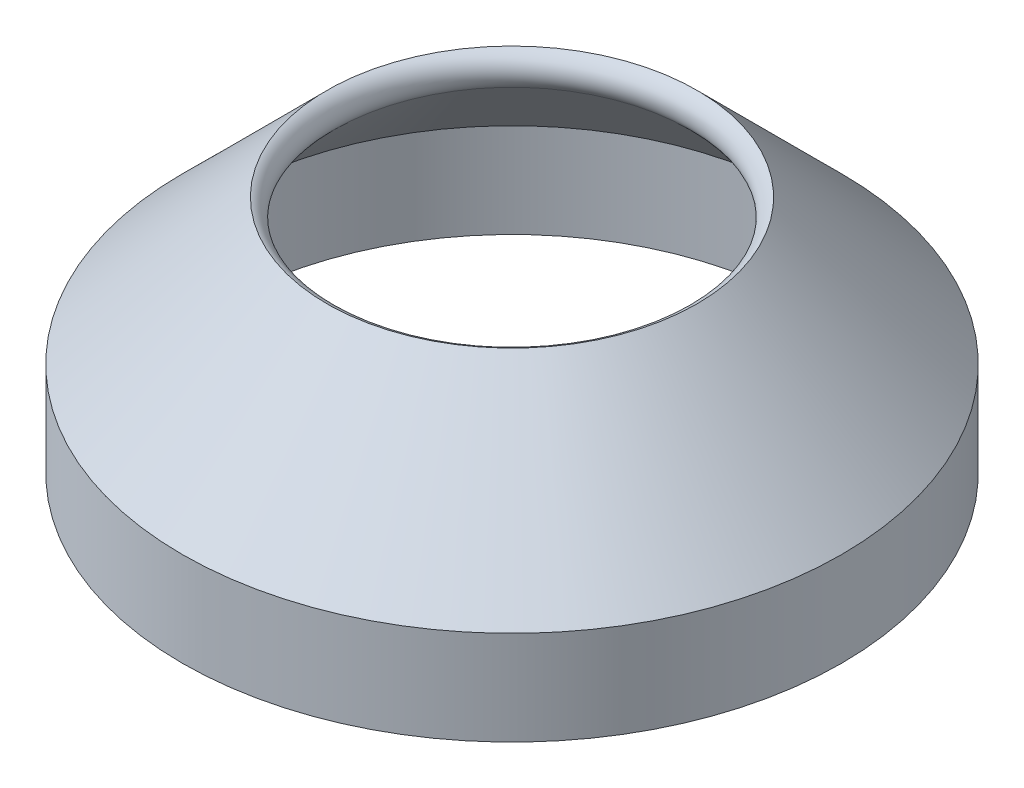
ISO-10303-21;
HEADER;
FILE_DESCRIPTION(('STEP AP214'),'2;1');
FILE_NAME('part.step','',(''),(''),'','','');
FILE_SCHEMA(('AUTOMOTIVE_DESIGN { 1 0 10303 214 1 1 1 1 }'));
ENDSEC;
DATA;
#1=APPLICATION_CONTEXT('core data for automotive mechanical design processes');
#2=APPLICATION_PROTOCOL_DEFINITION('international standard','automotive_design',2000,#1);
#3=PRODUCT_CONTEXT('',#1,'mechanical');
#4=PRODUCT('Part','Part','',(#3));
#5=PRODUCT_RELATED_PRODUCT_CATEGORY('part','',(#4));
#6=PRODUCT_DEFINITION_FORMATION('','',#4);
#7=PRODUCT_DEFINITION_CONTEXT('part definition',#1,'design');
#8=PRODUCT_DEFINITION('design','',#6,#7);
#9=PRODUCT_DEFINITION_SHAPE('','',#8);
#10=(LENGTH_UNIT() NAMED_UNIT(*) SI_UNIT(.MILLI.,.METRE.));
#11=(NAMED_UNIT(*) PLANE_ANGLE_UNIT() SI_UNIT($,.RADIAN.));
#12=(NAMED_UNIT(*) SI_UNIT($,.STERADIAN.) SOLID_ANGLE_UNIT());
#13=UNCERTAINTY_MEASURE_WITH_UNIT(LENGTH_MEASURE(1.E-05),#10,'distance_accuracy_value','');
#14=(GEOMETRIC_REPRESENTATION_CONTEXT(3) GLOBAL_UNCERTAINTY_ASSIGNED_CONTEXT((#13)) GLOBAL_UNIT_ASSIGNED_CONTEXT((#10,
#11,#12)) REPRESENTATION_CONTEXT('',''));
#15=CARTESIAN_POINT('',(0.,0.,0.));
#16=DIRECTION('',(0.,0.,1.));
#17=DIRECTION('',(1.,0.,0.));
#18=AXIS2_PLACEMENT_3D('',#15,#16,#17);
#19=CARTESIAN_POINT('',(-35.,0.,0.));
#20=DIRECTION('',(0.,1.,0.));
#21=DIRECTION('',(-1.,0.,0.));
#22=AXIS2_PLACEMENT_3D('',#19,#20,#21);
#23=PLANE('',#22);
#24=CARTESIAN_POINT('',(-33.,0.,-1.15218884181823E-13));
#25=DIRECTION('',(0.,-1.,0.));
#26=DIRECTION('',(1.,0.,0.));
#27=AXIS2_PLACEMENT_3D('',#24,#25,#26);
#28=CIRCLE('',#27,1.15);
#29=CARTESIAN_POINT('',(-31.85,0.,-1.11203680642154E-13));
#30=VERTEX_POINT('',#29);
#31=EDGE_CURVE('E98',#30,#30,#28,.T.);
#32=ORIENTED_EDGE('',*,*,#31,.F.);
#33=EDGE_LOOP('',(#32));
#34=FACE_BOUND('',#33,.T.);
#35=CARTESIAN_POINT('',(0.,0.,-33.));
#36=DIRECTION('',(0.,-1.,0.));
#37=DIRECTION('',(0.,0.,1.));
#38=AXIS2_PLACEMENT_3D('',#35,#36,#37);
#39=CIRCLE('',#38,1.15);
#40=CARTESIAN_POINT('',(0.,0.,-31.85));
#41=VERTEX_POINT('',#40);
#42=EDGE_CURVE('E90',#41,#41,#39,.T.);
#43=ORIENTED_EDGE('',*,*,#42,.F.);
#44=EDGE_LOOP('',(#43));
#45=FACE_BOUND('',#44,.T.);
#46=CARTESIAN_POINT('',(33.,0.,3.4565665254547E-13));
#47=DIRECTION('',(0.,-1.,0.));
#48=DIRECTION('',(-1.,0.,0.));
#49=AXIS2_PLACEMENT_3D('',#46,#47,#48);
#50=CIRCLE('',#49,1.15);
#51=CARTESIAN_POINT('',(31.85,0.,3.33611041926461E-13));
#52=VERTEX_POINT('',#51);
#53=EDGE_CURVE('E82',#52,#52,#50,.T.);
#54=ORIENTED_EDGE('',*,*,#53,.F.);
#55=EDGE_LOOP('',(#54));
#56=FACE_BOUND('',#55,.T.);
#57=CARTESIAN_POINT('',(0.,0.,33.));
#58=DIRECTION('',(0.,-1.,0.));
#59=DIRECTION('',(0.,0.,-1.));
#60=AXIS2_PLACEMENT_3D('',#57,#58,#59);
#61=CIRCLE('',#60,1.15);
#62=CARTESIAN_POINT('',(0.,0.,31.85));
#63=VERTEX_POINT('',#62);
#64=EDGE_CURVE('E74',#63,#63,#61,.T.);
#65=ORIENTED_EDGE('',*,*,#64,.F.);
#66=EDGE_LOOP('',(#65));
#67=FACE_BOUND('',#66,.T.);
#68=CARTESIAN_POINT('',(0.,0.,0.));
#69=DIRECTION('',(0.,-1.,0.));
#70=DIRECTION('',(1.,0.,0.));
#71=AXIS2_PLACEMENT_3D('',#68,#69,#70);
#72=CIRCLE('',#71,31.);
#73=CARTESIAN_POINT('',(31.,0.,0.));
#74=VERTEX_POINT('',#73);
#75=EDGE_CURVE('E49',#74,#74,#72,.T.);
#76=ORIENTED_EDGE('',*,*,#75,.F.);
#77=EDGE_LOOP('',(#76));
#78=FACE_BOUND('',#77,.T.);
#79=CARTESIAN_POINT('',(0.,0.,0.));
#80=DIRECTION('',(0.,-1.,0.));
#81=DIRECTION('',(1.,0.,0.));
#82=AXIS2_PLACEMENT_3D('',#79,#80,#81);
#83=CIRCLE('',#82,35.);
#84=CARTESIAN_POINT('',(35.,0.,0.));
#85=VERTEX_POINT('',#84);
#86=EDGE_CURVE('E69',#85,#85,#83,.T.);
#87=ORIENTED_EDGE('',*,*,#86,.T.);
#88=EDGE_LOOP('',(#87));
#89=FACE_BOUND('',#88,.T.);
#90=ADVANCED_FACE('F41',(#34,#45,#56,#67,#78,#89),#23,.F.);
#91=CARTESIAN_POINT('',(0.,0.,0.));
#92=DIRECTION('',(0.,-1.,0.));
#93=DIRECTION('',(1.,0.,0.));
#94=AXIS2_PLACEMENT_3D('',#91,#92,#93);
#95=CYLINDRICAL_SURFACE('',#94,31.);
#96=CARTESIAN_POINT('',(0.,10.,0.));
#97=DIRECTION('',(0.,-1.,0.));
#98=DIRECTION('',(1.,0.,0.));
#99=AXIS2_PLACEMENT_3D('',#96,#97,#98);
#100=CIRCLE('',#99,31.);
#101=CARTESIAN_POINT('',(31.,10.,0.));
#102=VERTEX_POINT('',#101);
#103=EDGE_CURVE('E54',#102,#102,#100,.T.);
#104=ORIENTED_EDGE('',*,*,#103,.F.);
#105=EDGE_LOOP('',(#104));
#106=FACE_BOUND('',#105,.T.);
#107=ORIENTED_EDGE('',*,*,#75,.T.);
#108=EDGE_LOOP('',(#107));
#109=FACE_BOUND('',#108,.T.);
#110=ADVANCED_FACE('F117',(#106,#109),#95,.F.);
#111=CARTESIAN_POINT('',(0.,10.,0.));
#112=DIRECTION('',(0.,-1.,0.));
#113=DIRECTION('',(1.,0.,0.));
#114=AXIS2_PLACEMENT_3D('',#111,#112,#113);
#115=CONICAL_SURFACE('',#114,31.,0.78539816339745);
#116=CARTESIAN_POINT('',(0.,22.07337682891,0.));
#117=DIRECTION('',(0.,1.,0.));
#118=DIRECTION('',(-1.,0.,0.));
#119=AXIS2_PLACEMENT_3D('',#116,#117,#118);
#120=CIRCLE('',#119,18.92662317109);
#121=CARTESIAN_POINT('',(-18.92662317109,22.07337682891,0.));
#122=VERTEX_POINT('',#121);
#123=EDGE_CURVE('E10',#122,#122,#120,.T.);
#124=ORIENTED_EDGE('',*,*,#123,.T.);
#125=EDGE_LOOP('',(#124));
#126=FACE_BOUND('',#125,.T.);
#127=ORIENTED_EDGE('',*,*,#103,.T.);
#128=EDGE_LOOP('',(#127));
#129=FACE_BOUND('',#128,.T.);
#130=ADVANCED_FACE('F136',(#126,#129),#115,.F.);
#131=CARTESIAN_POINT('',(0.,25.3605653347211,0.));
#132=DIRECTION('',(0.,-1.,0.));
#133=DIRECTION('',(1.,0.,0.));
#134=AXIS2_PLACEMENT_3D('',#131,#132,#133);
#135=CONICAL_SURFACE('',#134,19.6394346652789,0.78539816339745);
#136=CARTESIAN_POINT('',(0.,10.,0.));
#137=DIRECTION('',(0.,-1.,0.));
#138=DIRECTION('',(1.,0.,0.));
#139=AXIS2_PLACEMENT_3D('',#136,#137,#138);
#140=CIRCLE('',#139,35.);
#141=CARTESIAN_POINT('',(35.,10.,0.));
#142=VERTEX_POINT('',#141);
#143=EDGE_CURVE('E65',#142,#142,#140,.T.);
#144=ORIENTED_EDGE('',*,*,#143,.F.);
#145=EDGE_LOOP('',(#144));
#146=FACE_BOUND('',#145,.T.);
#147=CARTESIAN_POINT('',(0.,25.3605653347211,0.));
#148=DIRECTION('',(0.,-1.,0.));
#149=DIRECTION('',(1.,0.,0.));
#150=AXIS2_PLACEMENT_3D('',#147,#148,#149);
#151=CIRCLE('',#150,19.6394346652789);
#152=CARTESIAN_POINT('',(19.6394346652789,25.3605653347211,0.));
#153=VERTEX_POINT('',#152);
#154=EDGE_CURVE('E59',#153,#153,#151,.T.);
#155=ORIENTED_EDGE('',*,*,#154,.T.);
#156=EDGE_LOOP('',(#155));
#157=FACE_BOUND('',#156,.T.);
#158=ADVANCED_FACE('F130',(#146,#157),#135,.T.);
#159=CARTESIAN_POINT('',(0.,0.,0.));
#160=DIRECTION('',(0.,-1.,0.));
#161=DIRECTION('',(1.,0.,0.));
#162=AXIS2_PLACEMENT_3D('',#159,#160,#161);
#163=CYLINDRICAL_SURFACE('',#162,35.);
#164=ORIENTED_EDGE('',*,*,#86,.F.);
#165=EDGE_LOOP('',(#164));
#166=FACE_BOUND('',#165,.T.);
#167=ORIENTED_EDGE('',*,*,#143,.T.);
#168=EDGE_LOOP('',(#167));
#169=FACE_BOUND('',#168,.T.);
#170=ADVANCED_FACE('F127',(#166,#169),#163,.T.);
#171=CARTESIAN_POINT('',(0.,23.4875903912831,0.));
#172=DIRECTION('',(0.,1.,0.));
#173=DIRECTION('',(-1.,0.,0.));
#174=AXIS2_PLACEMENT_3D('',#171,#172,#173);
#175=TOROIDAL_SURFACE('',#174,20.3408367334631,2.);
#176=ORIENTED_EDGE('',*,*,#123,.F.);
#177=EDGE_LOOP('',(#176));
#178=FACE_BOUND('',#177,.T.);
#179=ORIENTED_EDGE('',*,*,#154,.F.);
#180=EDGE_LOOP('',(#179));
#181=FACE_BOUND('',#180,.T.);
#182=ADVANCED_FACE('F43',(#178,#181),#175,.T.);
#183=CARTESIAN_POINT('',(0.,10.,33.));
#184=DIRECTION('',(0.,-1.,0.));
#185=DIRECTION('',(0.,0.,-1.));
#186=AXIS2_PLACEMENT_3D('',#183,#184,#185);
#187=CYLINDRICAL_SURFACE('',#186,1.15);
#188=CARTESIAN_POINT('',(0.,10.,33.));
#189=DIRECTION('',(0.,-1.,0.));
#190=DIRECTION('',(0.,0.,-1.));
#191=AXIS2_PLACEMENT_3D('',#188,#189,#190);
#192=CIRCLE('',#191,1.15);
#193=CARTESIAN_POINT('',(0.,10.,31.85));
#194=VERTEX_POINT('',#193);
#195=EDGE_CURVE('E73',#194,#194,#192,.T.);
#196=ORIENTED_EDGE('',*,*,#195,.F.);
#197=EDGE_LOOP('',(#196));
#198=FACE_BOUND('',#197,.T.);
#199=ORIENTED_EDGE('',*,*,#64,.T.);
#200=EDGE_LOOP('',(#199));
#201=FACE_BOUND('',#200,.T.);
#202=ADVANCED_FACE('F141',(#198,#201),#187,.F.);
#203=CARTESIAN_POINT('',(0.,10.,33.));
#204=DIRECTION('',(0.,-1.,0.));
#205=DIRECTION('',(0.,0.,-1.));
#206=AXIS2_PLACEMENT_3D('',#203,#204,#205);
#207=PLANE('',#206);
#208=ORIENTED_EDGE('',*,*,#195,.T.);
#209=EDGE_LOOP('',(#208));
#210=FACE_BOUND('',#209,.T.);
#211=ADVANCED_FACE('F146',(#210),#207,.T.);
#212=CARTESIAN_POINT('',(33.,10.,3.4565665254547E-13));
#213=DIRECTION('',(0.,-1.,0.));
#214=DIRECTION('',(0.,0.,-1.));
#215=AXIS2_PLACEMENT_3D('',#212,#213,#214);
#216=CYLINDRICAL_SURFACE('',#215,1.15);
#217=CARTESIAN_POINT('',(33.,10.,3.4565665254547E-13));
#218=DIRECTION('',(0.,-1.,0.));
#219=DIRECTION('',(-1.,0.,0.));
#220=AXIS2_PLACEMENT_3D('',#217,#218,#219);
#221=CIRCLE('',#220,1.15);
#222=CARTESIAN_POINT('',(31.85,10.,3.33611041926461E-13));
#223=VERTEX_POINT('',#222);
#224=EDGE_CURVE('E86',#223,#223,#221,.T.);
#225=ORIENTED_EDGE('',*,*,#224,.F.);
#226=EDGE_LOOP('',(#225));
#227=FACE_BOUND('',#226,.T.);
#228=ORIENTED_EDGE('',*,*,#53,.T.);
#229=EDGE_LOOP('',(#228));
#230=FACE_BOUND('',#229,.T.);
#231=ADVANCED_FACE('F152',(#227,#230),#216,.F.);
#232=CARTESIAN_POINT('',(33.,10.,3.4565665254547E-13));
#233=DIRECTION('',(0.,-1.,0.));
#234=DIRECTION('',(-1.,0.,0.));
#235=AXIS2_PLACEMENT_3D('',#232,#233,#234);
#236=PLANE('',#235);
#237=ORIENTED_EDGE('',*,*,#224,.T.);
#238=EDGE_LOOP('',(#237));
#239=FACE_BOUND('',#238,.T.);
#240=ADVANCED_FACE('F216',(#239),#236,.T.);
#241=CARTESIAN_POINT('',(0.,10.,-33.));
#242=DIRECTION('',(0.,-1.,0.));
#243=DIRECTION('',(1.,0.,0.));
#244=AXIS2_PLACEMENT_3D('',#241,#242,#243);
#245=CYLINDRICAL_SURFACE('',#244,1.15);
#246=CARTESIAN_POINT('',(0.,10.,-33.));
#247=DIRECTION('',(0.,-1.,0.));
#248=DIRECTION('',(0.,0.,1.));
#249=AXIS2_PLACEMENT_3D('',#246,#247,#248);
#250=CIRCLE('',#249,1.15);
#251=CARTESIAN_POINT('',(0.,10.,-31.85));
#252=VERTEX_POINT('',#251);
#253=EDGE_CURVE('E94',#252,#252,#250,.T.);
#254=ORIENTED_EDGE('',*,*,#253,.F.);
#255=EDGE_LOOP('',(#254));
#256=FACE_BOUND('',#255,.T.);
#257=ORIENTED_EDGE('',*,*,#42,.T.);
#258=EDGE_LOOP('',(#257));
#259=FACE_BOUND('',#258,.T.);
#260=ADVANCED_FACE('F226',(#256,#259),#245,.F.);
#261=CARTESIAN_POINT('',(0.,10.,-33.));
#262=DIRECTION('',(0.,-1.,0.));
#263=DIRECTION('',(0.,0.,1.));
#264=AXIS2_PLACEMENT_3D('',#261,#262,#263);
#265=PLANE('',#264);
#266=ORIENTED_EDGE('',*,*,#253,.T.);
#267=EDGE_LOOP('',(#266));
#268=FACE_BOUND('',#267,.T.);
#269=ADVANCED_FACE('F111',(#268),#265,.T.);
#270=CARTESIAN_POINT('',(-33.,10.,-1.15218884181823E-13));
#271=DIRECTION('',(0.,-1.,0.));
#272=DIRECTION('',(1.,0.,0.));
#273=AXIS2_PLACEMENT_3D('',#270,#271,#272);
#274=CYLINDRICAL_SURFACE('',#273,1.15);
#275=CARTESIAN_POINT('',(-33.,10.,-1.15218884181823E-13));
#276=DIRECTION('',(0.,-1.,0.));
#277=DIRECTION('',(1.,0.,0.));
#278=AXIS2_PLACEMENT_3D('',#275,#276,#277);
#279=CIRCLE('',#278,1.15);
#280=CARTESIAN_POINT('',(-31.85,10.,-1.11203680642154E-13));
#281=VERTEX_POINT('',#280);
#282=EDGE_CURVE('E78',#281,#281,#279,.T.);
#283=ORIENTED_EDGE('',*,*,#282,.F.);
#284=EDGE_LOOP('',(#283));
#285=FACE_BOUND('',#284,.T.);
#286=ORIENTED_EDGE('',*,*,#31,.T.);
#287=EDGE_LOOP('',(#286));
#288=FACE_BOUND('',#287,.T.);
#289=ADVANCED_FACE('F108',(#285,#288),#274,.F.);
#290=CARTESIAN_POINT('',(-33.,10.,-1.15218884181823E-13));
#291=DIRECTION('',(0.,-1.,0.));
#292=DIRECTION('',(1.,0.,0.));
#293=AXIS2_PLACEMENT_3D('',#290,#291,#292);
#294=PLANE('',#293);
#295=ORIENTED_EDGE('',*,*,#282,.T.);
#296=EDGE_LOOP('',(#295));
#297=FACE_BOUND('',#296,.T.);
#298=ADVANCED_FACE('F106',(#297),#294,.T.);
#299=CLOSED_SHELL('',(#90,#110,#130,#158,#170,#182,#202,#211,#231,#240,#260,#269,#289,#298));
#300=MANIFOLD_SOLID_BREP('B2',#299);
#301=ADVANCED_BREP_SHAPE_REPRESENTATION('',(#18,#300),#14);
#302=SHAPE_DEFINITION_REPRESENTATION(#9,#301);
ENDSEC;
END-ISO-10303-21;
